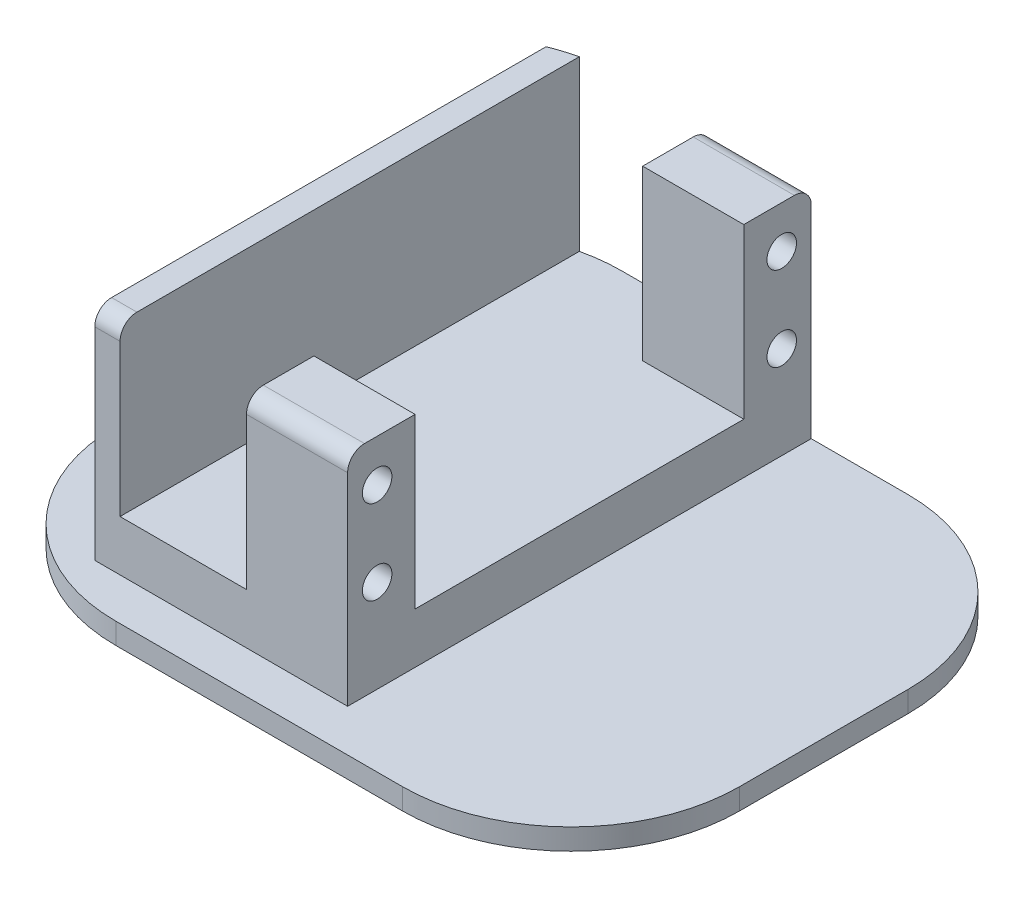
ISO-10303-21;
HEADER;
FILE_DESCRIPTION(('STEP AP214'),'2;1');
FILE_NAME('part.step','',(''),(''),'','','');
FILE_SCHEMA(('AUTOMOTIVE_DESIGN { 1 0 10303 214 1 1 1 1 }'));
ENDSEC;
DATA;
#1=APPLICATION_CONTEXT('core data for automotive mechanical design processes');
#2=APPLICATION_PROTOCOL_DEFINITION('international standard','automotive_design',2000,#1);
#3=PRODUCT_CONTEXT('',#1,'mechanical');
#4=PRODUCT('Part','Part','',(#3));
#5=PRODUCT_RELATED_PRODUCT_CATEGORY('part','',(#4));
#6=PRODUCT_DEFINITION_FORMATION('','',#4);
#7=PRODUCT_DEFINITION_CONTEXT('part definition',#1,'design');
#8=PRODUCT_DEFINITION('design','',#6,#7);
#9=PRODUCT_DEFINITION_SHAPE('','',#8);
#10=(LENGTH_UNIT() NAMED_UNIT(*) SI_UNIT(.MILLI.,.METRE.));
#11=(NAMED_UNIT(*) PLANE_ANGLE_UNIT() SI_UNIT($,.RADIAN.));
#12=(NAMED_UNIT(*) SI_UNIT($,.STERADIAN.) SOLID_ANGLE_UNIT());
#13=UNCERTAINTY_MEASURE_WITH_UNIT(LENGTH_MEASURE(1.E-05),#10,'distance_accuracy_value','');
#14=(GEOMETRIC_REPRESENTATION_CONTEXT(3) GLOBAL_UNCERTAINTY_ASSIGNED_CONTEXT((#13)) GLOBAL_UNIT_ASSIGNED_CONTEXT((#10,
#11,#12)) REPRESENTATION_CONTEXT('',''));
#15=CARTESIAN_POINT('',(0.,0.,0.));
#16=DIRECTION('',(0.,0.,1.));
#17=DIRECTION('',(1.,0.,0.));
#18=AXIS2_PLACEMENT_3D('',#15,#16,#17);
#19=CARTESIAN_POINT('',(12.5,8.5,-60.));
#20=DIRECTION('',(1.,0.,0.));
#21=DIRECTION('',(0.,0.,-1.));
#22=AXIS2_PLACEMENT_3D('',#19,#20,#21);
#23=PLANE('',#22);
#24=CARTESIAN_POINT('',(12.5,18.5,-42.));
#25=DIRECTION('',(1.,0.,0.));
#26=DIRECTION('',(0.,0.,-1.));
#27=AXIS2_PLACEMENT_3D('',#24,#25,#26);
#28=CIRCLE('',#27,3.95);
#29=CARTESIAN_POINT('',(12.5,18.5,-45.95));
#30=VERTEX_POINT('',#29);
#31=EDGE_CURVE('E395',#30,#30,#28,.T.);
#32=ORIENTED_EDGE('',*,*,#31,.T.);
#33=EDGE_LOOP('',(#32));
#34=FACE_BOUND('',#33,.T.);
#35=DIRECTION('',(0.,-1.,0.));
#36=VECTOR('',#35,1.);
#37=CARTESIAN_POINT('',(12.5,8.5,-5.));
#38=LINE('',#37,#36);
#39=CARTESIAN_POINT('',(12.5,26.5,-5.));
#40=VERTEX_POINT('',#39);
#41=CARTESIAN_POINT('',(12.5,2.5,-5.));
#42=VERTEX_POINT('',#41);
#43=EDGE_CURVE('E374',#40,#42,#38,.T.);
#44=ORIENTED_EDGE('',*,*,#43,.F.);
#45=CARTESIAN_POINT('',(12.5,26.5,-7.));
#46=DIRECTION('',(1.,0.,0.));
#47=DIRECTION('',(0.,0.,-1.));
#48=AXIS2_PLACEMENT_3D('',#45,#46,#47);
#49=CIRCLE('',#48,2.);
#50=CARTESIAN_POINT('',(12.5,28.5,-7.));
#51=VERTEX_POINT('',#50);
#52=EDGE_CURVE('E11',#40,#51,#49,.F.);
#53=ORIENTED_EDGE('',*,*,#52,.T.);
#54=DIRECTION('',(0.,0.,1.));
#55=VECTOR('',#54,1.);
#56=CARTESIAN_POINT('',(12.5,28.5,-52.));
#57=LINE('',#56,#55);
#58=CARTESIAN_POINT('',(12.5,28.5,-58.5404962177392));
#59=VERTEX_POINT('',#58);
#60=EDGE_CURVE('E218',#59,#51,#57,.T.);
#61=ORIENTED_EDGE('',*,*,#60,.F.);
#62=DIRECTION('',(0.,-1.,0.));
#63=VECTOR('',#62,1.);
#64=CARTESIAN_POINT('',(12.5,28.5,-58.5404962177392));
#65=LINE('',#64,#63);
#66=CARTESIAN_POINT('',(12.5,2.5,-58.5404962177392));
#67=VERTEX_POINT('',#66);
#68=EDGE_CURVE('E329',#59,#67,#65,.T.);
#69=ORIENTED_EDGE('',*,*,#68,.T.);
#70=DIRECTION('',(0.,0.,1.));
#71=VECTOR('',#70,1.);
#72=CARTESIAN_POINT('',(12.5,2.5,-60.));
#73=LINE('',#72,#71);
#74=EDGE_CURVE('E287',#67,#42,#73,.T.);
#75=ORIENTED_EDGE('',*,*,#74,.T.);
#76=EDGE_LOOP('',(#44,#53,#61,#69,#75));
#77=FACE_BOUND('',#76,.T.);
#78=ADVANCED_FACE('F33',(#34,#77),#23,.F.);
#79=CARTESIAN_POINT('',(0.,8.5,0.));
#80=DIRECTION('',(0.,1.,0.));
#81=DIRECTION('',(0.,0.,1.));
#82=AXIS2_PLACEMENT_3D('',#79,#80,#81);
#83=PLANE('',#82);
#84=DIRECTION('',(-1.,0.,0.));
#85=VECTOR('',#84,1.);
#86=CARTESIAN_POINT('',(12.5,8.5,-60.));
#87=LINE('',#86,#85);
#88=CARTESIAN_POINT('',(30.5,8.5,-60.));
#89=VERTEX_POINT('',#88);
#90=CARTESIAN_POINT('',(20.,8.5,-60.));
#91=VERTEX_POINT('',#90);
#92=EDGE_CURVE('E254',#89,#91,#87,.T.);
#93=ORIENTED_EDGE('',*,*,#92,.T.);
#94=CARTESIAN_POINT('',(20.,8.5,-40.));
#95=DIRECTION('',(0.,1.,0.));
#96=DIRECTION('',(0.,0.,1.));
#97=AXIS2_PLACEMENT_3D('',#94,#95,#96);
#98=CIRCLE('',#97,20.);
#99=CARTESIAN_POINT('',(15.5,8.5,-59.4871752699051));
#100=VERTEX_POINT('',#99);
#101=EDGE_CURVE('E343',#91,#100,#98,.T.);
#102=ORIENTED_EDGE('',*,*,#101,.T.);
#103=DIRECTION('',(0.,0.,-1.));
#104=VECTOR('',#103,1.);
#105=CARTESIAN_POINT('',(15.5,8.5,-52.));
#106=LINE('',#105,#104);
#107=CARTESIAN_POINT('',(15.5,8.5,-5.));
#108=VERTEX_POINT('',#107);
#109=EDGE_CURVE('E215',#108,#100,#106,.T.);
#110=ORIENTED_EDGE('',*,*,#109,.F.);
#111=DIRECTION('',(1.,0.,0.));
#112=VECTOR('',#111,1.);
#113=CARTESIAN_POINT('',(12.5,8.5,-5.));
#114=LINE('',#113,#112);
#115=CARTESIAN_POINT('',(30.5,8.5,-5.));
#116=VERTEX_POINT('',#115);
#117=EDGE_CURVE('E255',#108,#116,#114,.T.);
#118=ORIENTED_EDGE('',*,*,#117,.T.);
#119=DIRECTION('',(0.,0.,1.));
#120=VECTOR('',#119,1.);
#121=CARTESIAN_POINT('',(30.5,8.5,-13.));
#122=LINE('',#121,#120);
#123=CARTESIAN_POINT('',(30.5,8.5,-13.));
#124=VERTEX_POINT('',#123);
#125=EDGE_CURVE('E198',#124,#116,#122,.T.);
#126=ORIENTED_EDGE('',*,*,#125,.F.);
#127=DIRECTION('',(-1.,0.,0.));
#128=VECTOR('',#127,1.);
#129=CARTESIAN_POINT('',(30.5,8.5,-13.));
#130=LINE('',#129,#128);
#131=CARTESIAN_POINT('',(42.5,8.5,-13.));
#132=VERTEX_POINT('',#131);
#133=EDGE_CURVE('E524',#132,#124,#130,.T.);
#134=ORIENTED_EDGE('',*,*,#133,.F.);
#135=DIRECTION('',(0.,0.,-1.));
#136=VECTOR('',#135,1.);
#137=CARTESIAN_POINT('',(42.5,8.5,-60.));
#138=LINE('',#137,#136);
#139=CARTESIAN_POINT('',(42.5,8.5,-52.));
#140=VERTEX_POINT('',#139);
#141=EDGE_CURVE('E213',#132,#140,#138,.T.);
#142=ORIENTED_EDGE('',*,*,#141,.T.);
#143=DIRECTION('',(1.,0.,0.));
#144=VECTOR('',#143,1.);
#145=CARTESIAN_POINT('',(42.5,8.5,-52.));
#146=LINE('',#145,#144);
#147=CARTESIAN_POINT('',(30.5,8.5,-52.));
#148=VERTEX_POINT('',#147);
#149=EDGE_CURVE('E234',#148,#140,#146,.T.);
#150=ORIENTED_EDGE('',*,*,#149,.F.);
#151=DIRECTION('',(0.,0.,1.));
#152=VECTOR('',#151,1.);
#153=CARTESIAN_POINT('',(30.5,8.5,-52.));
#154=LINE('',#153,#152);
#155=EDGE_CURVE('E229',#89,#148,#154,.T.);
#156=ORIENTED_EDGE('',*,*,#155,.F.);
#157=EDGE_LOOP('',(#93,#102,#110,#118,#126,#134,#142,#150,#156));
#158=FACE_BOUND('',#157,.T.);
#159=ADVANCED_FACE('F463',(#158),#83,.T.);
#160=CARTESIAN_POINT('',(0.,2.5,0.));
#161=DIRECTION('',(0.,-1.,0.));
#162=DIRECTION('',(0.,0.,-1.));
#163=AXIS2_PLACEMENT_3D('',#160,#161,#162);
#164=PLANE('',#163);
#165=DIRECTION('',(0.,0.,-1.));
#166=VECTOR('',#165,1.);
#167=CARTESIAN_POINT('',(74.,2.5,0.));
#168=LINE('',#167,#166);
#169=CARTESIAN_POINT('',(74.,2.5,-20.));
#170=VERTEX_POINT('',#169);
#171=CARTESIAN_POINT('',(74.,2.5,-40.));
#172=VERTEX_POINT('',#171);
#173=EDGE_CURVE('E383',#170,#172,#168,.T.);
#174=ORIENTED_EDGE('',*,*,#173,.T.);
#175=CARTESIAN_POINT('',(54.,2.5,-40.));
#176=DIRECTION('',(0.,-1.,0.));
#177=DIRECTION('',(0.,0.,-1.));
#178=AXIS2_PLACEMENT_3D('',#175,#176,#177);
#179=CIRCLE('',#178,20.);
#180=CARTESIAN_POINT('',(54.,2.5,-60.));
#181=VERTEX_POINT('',#180);
#182=EDGE_CURVE('E355',#172,#181,#179,.F.);
#183=ORIENTED_EDGE('',*,*,#182,.T.);
#184=DIRECTION('',(-1.,0.,0.));
#185=VECTOR('',#184,1.);
#186=CARTESIAN_POINT('',(0.,2.5,-60.));
#187=LINE('',#186,#185);
#188=CARTESIAN_POINT('',(42.5,2.5,-60.));
#189=VERTEX_POINT('',#188);
#190=EDGE_CURVE('E386',#181,#189,#187,.T.);
#191=ORIENTED_EDGE('',*,*,#190,.T.);
#192=DIRECTION('',(0.,0.,-1.));
#193=VECTOR('',#192,1.);
#194=CARTESIAN_POINT('',(42.5,2.5,-60.));
#195=LINE('',#194,#193);
#196=CARTESIAN_POINT('',(42.5,2.5,-5.));
#197=VERTEX_POINT('',#196);
#198=EDGE_CURVE('E369',#197,#189,#195,.T.);
#199=ORIENTED_EDGE('',*,*,#198,.F.);
#200=DIRECTION('',(1.,0.,0.));
#201=VECTOR('',#200,1.);
#202=CARTESIAN_POINT('',(12.5,2.5,-5.));
#203=LINE('',#202,#201);
#204=EDGE_CURVE('E262',#42,#197,#203,.T.);
#205=ORIENTED_EDGE('',*,*,#204,.F.);
#206=ORIENTED_EDGE('',*,*,#74,.F.);
#207=CARTESIAN_POINT('',(20.,2.5,-40.));
#208=DIRECTION('',(0.,-1.,0.));
#209=DIRECTION('',(0.,0.,-1.));
#210=AXIS2_PLACEMENT_3D('',#207,#208,#209);
#211=CIRCLE('',#210,20.);
#212=CARTESIAN_POINT('',(0.,2.5,-40.));
#213=VERTEX_POINT('',#212);
#214=EDGE_CURVE('E337',#67,#213,#211,.F.);
#215=ORIENTED_EDGE('',*,*,#214,.T.);
#216=DIRECTION('',(0.,0.,1.));
#217=VECTOR('',#216,1.);
#218=CARTESIAN_POINT('',(0.,2.5,0.));
#219=LINE('',#218,#217);
#220=CARTESIAN_POINT('',(0.,2.5,-20.));
#221=VERTEX_POINT('',#220);
#222=EDGE_CURVE('E377',#213,#221,#219,.T.);
#223=ORIENTED_EDGE('',*,*,#222,.T.);
#224=CARTESIAN_POINT('',(20.,2.5,-20.));
#225=DIRECTION('',(0.,-1.,0.));
#226=DIRECTION('',(0.,0.,-1.));
#227=AXIS2_PLACEMENT_3D('',#224,#225,#226);
#228=CIRCLE('',#227,20.);
#229=CARTESIAN_POINT('',(20.,2.5,0.));
#230=VERTEX_POINT('',#229);
#231=EDGE_CURVE('E359',#221,#230,#228,.F.);
#232=ORIENTED_EDGE('',*,*,#231,.T.);
#233=DIRECTION('',(1.,0.,0.));
#234=VECTOR('',#233,1.);
#235=CARTESIAN_POINT('',(0.,2.5,0.));
#236=LINE('',#235,#234);
#237=CARTESIAN_POINT('',(54.,2.5,0.));
#238=VERTEX_POINT('',#237);
#239=EDGE_CURVE('E380',#230,#238,#236,.T.);
#240=ORIENTED_EDGE('',*,*,#239,.T.);
#241=CARTESIAN_POINT('',(54.,2.5,-20.));
#242=DIRECTION('',(0.,-1.,0.));
#243=DIRECTION('',(0.,0.,-1.));
#244=AXIS2_PLACEMENT_3D('',#241,#242,#243);
#245=CIRCLE('',#244,20.);
#246=EDGE_CURVE('E357',#238,#170,#245,.F.);
#247=ORIENTED_EDGE('',*,*,#246,.T.);
#248=EDGE_LOOP('',(#174,#183,#191,#199,#205,#206,#215,#223,#232,#240,#247));
#249=FACE_BOUND('',#248,.T.);
#250=ADVANCED_FACE('F422',(#249),#164,.F.);
#251=CARTESIAN_POINT('',(0.,2.5,0.));
#252=DIRECTION('',(1.,0.,0.));
#253=DIRECTION('',(0.,0.,-1.));
#254=AXIS2_PLACEMENT_3D('',#251,#252,#253);
#255=PLANE('',#254);
#256=DIRECTION('',(0.,0.,1.));
#257=VECTOR('',#256,1.);
#258=CARTESIAN_POINT('',(0.,0.,0.));
#259=LINE('',#258,#257);
#260=CARTESIAN_POINT('',(0.,0.,-40.));
#261=VERTEX_POINT('',#260);
#262=CARTESIAN_POINT('',(0.,0.,-20.));
#263=VERTEX_POINT('',#262);
#264=EDGE_CURVE('E376',#261,#263,#259,.T.);
#265=ORIENTED_EDGE('',*,*,#264,.T.);
#266=DIRECTION('',(0.,-1.,0.));
#267=VECTOR('',#266,1.);
#268=CARTESIAN_POINT('',(0.,2.5,-20.));
#269=LINE('',#268,#267);
#270=EDGE_CURVE('E345',#263,#221,#269,.F.);
#271=ORIENTED_EDGE('',*,*,#270,.T.);
#272=ORIENTED_EDGE('',*,*,#222,.F.);
#273=DIRECTION('',(0.,-1.,0.));
#274=VECTOR('',#273,1.);
#275=CARTESIAN_POINT('',(0.,2.5,-40.));
#276=LINE('',#275,#274);
#277=EDGE_CURVE('E347',#213,#261,#276,.T.);
#278=ORIENTED_EDGE('',*,*,#277,.T.);
#279=EDGE_LOOP('',(#265,#271,#272,#278));
#280=FACE_BOUND('',#279,.T.);
#281=ADVANCED_FACE('F443',(#280),#255,.F.);
#282=CARTESIAN_POINT('',(0.,2.5,0.));
#283=DIRECTION('',(0.,0.,-1.));
#284=DIRECTION('',(-1.,0.,0.));
#285=AXIS2_PLACEMENT_3D('',#282,#283,#284);
#286=PLANE('',#285);
#287=DIRECTION('',(1.,0.,0.));
#288=VECTOR('',#287,1.);
#289=CARTESIAN_POINT('',(0.,0.,0.));
#290=LINE('',#289,#288);
#291=CARTESIAN_POINT('',(20.,0.,0.));
#292=VERTEX_POINT('',#291);
#293=CARTESIAN_POINT('',(54.,0.,0.));
#294=VERTEX_POINT('',#293);
#295=EDGE_CURVE('E435',#292,#294,#290,.T.);
#296=ORIENTED_EDGE('',*,*,#295,.T.);
#297=DIRECTION('',(0.,-1.,0.));
#298=VECTOR('',#297,1.);
#299=CARTESIAN_POINT('',(54.,2.5,0.));
#300=LINE('',#299,#298);
#301=EDGE_CURVE('E350',#294,#238,#300,.F.);
#302=ORIENTED_EDGE('',*,*,#301,.T.);
#303=ORIENTED_EDGE('',*,*,#239,.F.);
#304=DIRECTION('',(0.,-1.,0.));
#305=VECTOR('',#304,1.);
#306=CARTESIAN_POINT('',(20.,2.5,0.));
#307=LINE('',#306,#305);
#308=EDGE_CURVE('E352',#230,#292,#307,.T.);
#309=ORIENTED_EDGE('',*,*,#308,.T.);
#310=EDGE_LOOP('',(#296,#302,#303,#309));
#311=FACE_BOUND('',#310,.T.);
#312=ADVANCED_FACE('F450',(#311),#286,.F.);
#313=CARTESIAN_POINT('',(74.,2.5,0.));
#314=DIRECTION('',(-1.,0.,0.));
#315=DIRECTION('',(0.,0.,1.));
#316=AXIS2_PLACEMENT_3D('',#313,#314,#315);
#317=PLANE('',#316);
#318=DIRECTION('',(0.,0.,-1.));
#319=VECTOR('',#318,1.);
#320=CARTESIAN_POINT('',(74.,0.,0.));
#321=LINE('',#320,#319);
#322=CARTESIAN_POINT('',(74.,0.,-20.));
#323=VERTEX_POINT('',#322);
#324=CARTESIAN_POINT('',(74.,0.,-40.));
#325=VERTEX_POINT('',#324);
#326=EDGE_CURVE('E418',#323,#325,#321,.T.);
#327=ORIENTED_EDGE('',*,*,#326,.T.);
#328=DIRECTION('',(0.,-1.,0.));
#329=VECTOR('',#328,1.);
#330=CARTESIAN_POINT('',(74.,2.5,-40.));
#331=LINE('',#330,#329);
#332=EDGE_CURVE('E361',#325,#172,#331,.F.);
#333=ORIENTED_EDGE('',*,*,#332,.T.);
#334=ORIENTED_EDGE('',*,*,#173,.F.);
#335=DIRECTION('',(0.,-1.,0.));
#336=VECTOR('',#335,1.);
#337=CARTESIAN_POINT('',(74.,2.5,-20.));
#338=LINE('',#337,#336);
#339=EDGE_CURVE('E409',#170,#323,#338,.T.);
#340=ORIENTED_EDGE('',*,*,#339,.T.);
#341=EDGE_LOOP('',(#327,#333,#334,#340));
#342=FACE_BOUND('',#341,.T.);
#343=ADVANCED_FACE('F417',(#342),#317,.F.);
#344=CARTESIAN_POINT('',(0.,2.5,-60.));
#345=DIRECTION('',(0.,0.,1.));
#346=DIRECTION('',(1.,0.,0.));
#347=AXIS2_PLACEMENT_3D('',#344,#345,#346);
#348=PLANE('',#347);
#349=DIRECTION('',(0.,-1.,0.));
#350=VECTOR('',#349,1.);
#351=CARTESIAN_POINT('',(30.5,28.5,-60.));
#352=LINE('',#351,#350);
#353=CARTESIAN_POINT('',(30.5,26.5,-60.));
#354=VERTEX_POINT('',#353);
#355=EDGE_CURVE('E281',#354,#89,#352,.T.);
#356=ORIENTED_EDGE('',*,*,#355,.F.);
#357=DIRECTION('',(-1.,0.,0.));
#358=VECTOR('',#357,1.);
#359=CARTESIAN_POINT('',(0.,26.5,-60.));
#360=LINE('',#359,#358);
#361=CARTESIAN_POINT('',(42.5,26.5,-60.));
#362=VERTEX_POINT('',#361);
#363=EDGE_CURVE('E297',#354,#362,#360,.F.);
#364=ORIENTED_EDGE('',*,*,#363,.T.);
#365=DIRECTION('',(0.,-1.,0.));
#366=VECTOR('',#365,1.);
#367=CARTESIAN_POINT('',(42.5,8.5,-60.));
#368=LINE('',#367,#366);
#369=EDGE_CURVE('E268',#362,#189,#368,.T.);
#370=ORIENTED_EDGE('',*,*,#369,.T.);
#371=ORIENTED_EDGE('',*,*,#190,.F.);
#372=DIRECTION('',(0.,-1.,0.));
#373=VECTOR('',#372,1.);
#374=CARTESIAN_POINT('',(54.,2.5,-60.));
#375=LINE('',#374,#373);
#376=CARTESIAN_POINT('',(54.,0.,-60.));
#377=VERTEX_POINT('',#376);
#378=EDGE_CURVE('E399',#181,#377,#375,.T.);
#379=ORIENTED_EDGE('',*,*,#378,.T.);
#380=DIRECTION('',(-1.,0.,0.));
#381=VECTOR('',#380,1.);
#382=CARTESIAN_POINT('',(0.,0.,-60.));
#383=LINE('',#382,#381);
#384=CARTESIAN_POINT('',(20.,0.,-60.));
#385=VERTEX_POINT('',#384);
#386=EDGE_CURVE('E367',#377,#385,#383,.T.);
#387=ORIENTED_EDGE('',*,*,#386,.T.);
#388=DIRECTION('',(0.,-1.,0.));
#389=VECTOR('',#388,1.);
#390=CARTESIAN_POINT('',(20.,2.5,-60.));
#391=LINE('',#390,#389);
#392=EDGE_CURVE('E397',#385,#91,#391,.F.);
#393=ORIENTED_EDGE('',*,*,#392,.T.);
#394=ORIENTED_EDGE('',*,*,#92,.F.);
#395=EDGE_LOOP('',(#356,#364,#370,#371,#379,#387,#393,#394));
#396=FACE_BOUND('',#395,.T.);
#397=ADVANCED_FACE('F430',(#396),#348,.F.);
#398=CARTESIAN_POINT('',(0.,0.,0.));
#399=DIRECTION('',(0.,-1.,0.));
#400=DIRECTION('',(0.,0.,-1.));
#401=AXIS2_PLACEMENT_3D('',#398,#399,#400);
#402=PLANE('',#401);
#403=ORIENTED_EDGE('',*,*,#386,.F.);
#404=CARTESIAN_POINT('',(54.,0.,-40.));
#405=DIRECTION('',(0.,-1.,0.));
#406=DIRECTION('',(0.,0.,-1.));
#407=AXIS2_PLACEMENT_3D('',#404,#405,#406);
#408=CIRCLE('',#407,20.);
#409=EDGE_CURVE('E408',#377,#325,#408,.T.);
#410=ORIENTED_EDGE('',*,*,#409,.T.);
#411=ORIENTED_EDGE('',*,*,#326,.F.);
#412=CARTESIAN_POINT('',(54.,0.,-20.));
#413=DIRECTION('',(0.,-1.,0.));
#414=DIRECTION('',(0.,0.,-1.));
#415=AXIS2_PLACEMENT_3D('',#412,#413,#414);
#416=CIRCLE('',#415,20.);
#417=EDGE_CURVE('E406',#323,#294,#416,.T.);
#418=ORIENTED_EDGE('',*,*,#417,.T.);
#419=ORIENTED_EDGE('',*,*,#295,.F.);
#420=CARTESIAN_POINT('',(20.,0.,-20.));
#421=DIRECTION('',(0.,-1.,0.));
#422=DIRECTION('',(0.,0.,-1.));
#423=AXIS2_PLACEMENT_3D('',#420,#421,#422);
#424=CIRCLE('',#423,20.);
#425=EDGE_CURVE('E404',#292,#263,#424,.T.);
#426=ORIENTED_EDGE('',*,*,#425,.T.);
#427=ORIENTED_EDGE('',*,*,#264,.F.);
#428=CARTESIAN_POINT('',(20.,0.,-40.));
#429=DIRECTION('',(0.,-1.,0.));
#430=DIRECTION('',(0.,0.,-1.));
#431=AXIS2_PLACEMENT_3D('',#428,#429,#430);
#432=CIRCLE('',#431,20.);
#433=EDGE_CURVE('E402',#261,#385,#432,.T.);
#434=ORIENTED_EDGE('',*,*,#433,.T.);
#435=EDGE_LOOP('',(#403,#410,#411,#418,#419,#426,#427,#434));
#436=FACE_BOUND('',#435,.T.);
#437=ADVANCED_FACE('F433',(#436),#402,.T.);
#438=CARTESIAN_POINT('',(12.5,8.5,-5.));
#439=DIRECTION('',(0.,0.,-1.));
#440=DIRECTION('',(-1.,0.,0.));
#441=AXIS2_PLACEMENT_3D('',#438,#439,#440);
#442=PLANE('',#441);
#443=DIRECTION('',(0.,-1.,0.));
#444=VECTOR('',#443,1.);
#445=CARTESIAN_POINT('',(42.5,8.5,-5.));
#446=LINE('',#445,#444);
#447=CARTESIAN_POINT('',(42.5,26.5,-5.));
#448=VERTEX_POINT('',#447);
#449=EDGE_CURVE('E299',#448,#197,#446,.T.);
#450=ORIENTED_EDGE('',*,*,#449,.F.);
#451=DIRECTION('',(1.,0.,0.));
#452=VECTOR('',#451,1.);
#453=CARTESIAN_POINT('',(12.5,26.5,-5.));
#454=LINE('',#453,#452);
#455=CARTESIAN_POINT('',(30.5,26.5,-5.));
#456=VERTEX_POINT('',#455);
#457=EDGE_CURVE('E308',#448,#456,#454,.F.);
#458=ORIENTED_EDGE('',*,*,#457,.T.);
#459=DIRECTION('',(0.,-1.,0.));
#460=VECTOR('',#459,1.);
#461=CARTESIAN_POINT('',(30.5,28.5,-5.));
#462=LINE('',#461,#460);
#463=EDGE_CURVE('E220',#456,#116,#462,.T.);
#464=ORIENTED_EDGE('',*,*,#463,.T.);
#465=ORIENTED_EDGE('',*,*,#117,.F.);
#466=DIRECTION('',(0.,-1.,0.));
#467=VECTOR('',#466,1.);
#468=CARTESIAN_POINT('',(15.5,28.5,-5.));
#469=LINE('',#468,#467);
#470=CARTESIAN_POINT('',(15.5,26.5,-5.));
#471=VERTEX_POINT('',#470);
#472=EDGE_CURVE('E226',#471,#108,#469,.T.);
#473=ORIENTED_EDGE('',*,*,#472,.F.);
#474=DIRECTION('',(1.,0.,0.));
#475=VECTOR('',#474,1.);
#476=CARTESIAN_POINT('',(12.5,26.5,-5.));
#477=LINE('',#476,#475);
#478=EDGE_CURVE('E306',#471,#40,#477,.F.);
#479=ORIENTED_EDGE('',*,*,#478,.T.);
#480=ORIENTED_EDGE('',*,*,#43,.T.);
#481=ORIENTED_EDGE('',*,*,#204,.T.);
#482=EDGE_LOOP('',(#450,#458,#464,#465,#473,#479,#480,#481));
#483=FACE_BOUND('',#482,.T.);
#484=ADVANCED_FACE('F322',(#483),#442,.F.);
#485=CARTESIAN_POINT('',(42.5,8.5,-60.));
#486=DIRECTION('',(-1.,0.,0.));
#487=DIRECTION('',(0.,0.,1.));
#488=AXIS2_PLACEMENT_3D('',#485,#486,#487);
#489=PLANE('',#488);
#490=CARTESIAN_POINT('',(42.5,13.5,-56.5));
#491=DIRECTION('',(1.,0.,0.));
#492=DIRECTION('',(0.,0.,-1.));
#493=AXIS2_PLACEMENT_3D('',#490,#491,#492);
#494=CIRCLE('',#493,1.75);
#495=CARTESIAN_POINT('',(42.5,13.5,-58.25));
#496=VERTEX_POINT('',#495);
#497=EDGE_CURVE('E505',#496,#496,#494,.T.);
#498=ORIENTED_EDGE('',*,*,#497,.F.);
#499=EDGE_LOOP('',(#498));
#500=FACE_BOUND('',#499,.T.);
#501=CARTESIAN_POINT('',(42.5,23.5,-56.5));
#502=DIRECTION('',(1.,0.,0.));
#503=DIRECTION('',(0.,0.,-1.));
#504=AXIS2_PLACEMENT_3D('',#501,#502,#503);
#505=CIRCLE('',#504,1.75);
#506=CARTESIAN_POINT('',(42.5,23.5,-58.25));
#507=VERTEX_POINT('',#506);
#508=EDGE_CURVE('E504',#507,#507,#505,.T.);
#509=ORIENTED_EDGE('',*,*,#508,.F.);
#510=EDGE_LOOP('',(#509));
#511=FACE_BOUND('',#510,.T.);
#512=CARTESIAN_POINT('',(42.5,13.5,-8.5));
#513=DIRECTION('',(1.,0.,0.));
#514=DIRECTION('',(0.,0.,-1.));
#515=AXIS2_PLACEMENT_3D('',#512,#513,#514);
#516=CIRCLE('',#515,1.75);
#517=CARTESIAN_POINT('',(42.5,13.5,-10.25));
#518=VERTEX_POINT('',#517);
#519=EDGE_CURVE('E508',#518,#518,#516,.T.);
#520=ORIENTED_EDGE('',*,*,#519,.F.);
#521=EDGE_LOOP('',(#520));
#522=FACE_BOUND('',#521,.T.);
#523=CARTESIAN_POINT('',(42.5,23.5,-8.5));
#524=DIRECTION('',(1.,0.,0.));
#525=DIRECTION('',(0.,0.,-1.));
#526=AXIS2_PLACEMENT_3D('',#523,#524,#525);
#527=CIRCLE('',#526,1.75);
#528=CARTESIAN_POINT('',(42.5,23.5,-10.25));
#529=VERTEX_POINT('',#528);
#530=EDGE_CURVE('E511',#529,#529,#527,.T.);
#531=ORIENTED_EDGE('',*,*,#530,.F.);
#532=EDGE_LOOP('',(#531));
#533=FACE_BOUND('',#532,.T.);
#534=ORIENTED_EDGE('',*,*,#369,.F.);
#535=CARTESIAN_POINT('',(42.5,26.5,-58.));
#536=DIRECTION('',(-1.,0.,0.));
#537=DIRECTION('',(0.,0.,1.));
#538=AXIS2_PLACEMENT_3D('',#535,#536,#537);
#539=CIRCLE('',#538,2.);
#540=CARTESIAN_POINT('',(42.5,28.5,-58.));
#541=VERTEX_POINT('',#540);
#542=EDGE_CURVE('E303',#362,#541,#539,.F.);
#543=ORIENTED_EDGE('',*,*,#542,.T.);
#544=DIRECTION('',(0.,0.,-1.));
#545=VECTOR('',#544,1.);
#546=CARTESIAN_POINT('',(42.5,28.5,-60.));
#547=LINE('',#546,#545);
#548=CARTESIAN_POINT('',(42.5,28.5,-52.));
#549=VERTEX_POINT('',#548);
#550=EDGE_CURVE('E230',#549,#541,#547,.T.);
#551=ORIENTED_EDGE('',*,*,#550,.F.);
#552=DIRECTION('',(0.,-1.,0.));
#553=VECTOR('',#552,1.);
#554=CARTESIAN_POINT('',(42.5,28.5,-52.));
#555=LINE('',#554,#553);
#556=EDGE_CURVE('E238',#549,#140,#555,.T.);
#557=ORIENTED_EDGE('',*,*,#556,.T.);
#558=ORIENTED_EDGE('',*,*,#141,.F.);
#559=DIRECTION('',(0.,-1.,0.));
#560=VECTOR('',#559,1.);
#561=CARTESIAN_POINT('',(42.5,28.5,-13.));
#562=LINE('',#561,#560);
#563=CARTESIAN_POINT('',(42.5,28.5,-13.));
#564=VERTEX_POINT('',#563);
#565=EDGE_CURVE('E204',#564,#132,#562,.T.);
#566=ORIENTED_EDGE('',*,*,#565,.F.);
#567=DIRECTION('',(0.,0.,-1.));
#568=VECTOR('',#567,1.);
#569=CARTESIAN_POINT('',(42.5,28.5,-5.));
#570=LINE('',#569,#568);
#571=CARTESIAN_POINT('',(42.5,28.5,-7.));
#572=VERTEX_POINT('',#571);
#573=EDGE_CURVE('E188',#572,#564,#570,.T.);
#574=ORIENTED_EDGE('',*,*,#573,.F.);
#575=CARTESIAN_POINT('',(42.5,26.5,-7.));
#576=DIRECTION('',(-1.,0.,0.));
#577=DIRECTION('',(0.,0.,1.));
#578=AXIS2_PLACEMENT_3D('',#575,#576,#577);
#579=CIRCLE('',#578,2.);
#580=EDGE_CURVE('E301',#572,#448,#579,.F.);
#581=ORIENTED_EDGE('',*,*,#580,.T.);
#582=ORIENTED_EDGE('',*,*,#449,.T.);
#583=ORIENTED_EDGE('',*,*,#198,.T.);
#584=EDGE_LOOP('',(#534,#543,#551,#557,#558,#566,#574,#581,#582,#583));
#585=FACE_BOUND('',#584,.T.);
#586=ADVANCED_FACE('F211',(#500,#511,#522,#533,#585),#489,.F.);
#587=CARTESIAN_POINT('',(30.5,28.5,-52.));
#588=DIRECTION('',(1.,0.,0.));
#589=DIRECTION('',(0.,0.,-1.));
#590=AXIS2_PLACEMENT_3D('',#587,#588,#589);
#591=PLANE('',#590);
#592=CARTESIAN_POINT('',(30.5,13.5,-56.5));
#593=DIRECTION('',(1.,0.,0.));
#594=DIRECTION('',(0.,0.,-1.));
#595=AXIS2_PLACEMENT_3D('',#592,#593,#594);
#596=CIRCLE('',#595,1.75);
#597=CARTESIAN_POINT('',(30.5,13.5,-58.25));
#598=VERTEX_POINT('',#597);
#599=EDGE_CURVE('E501',#598,#598,#596,.T.);
#600=ORIENTED_EDGE('',*,*,#599,.T.);
#601=EDGE_LOOP('',(#600));
#602=FACE_BOUND('',#601,.T.);
#603=CARTESIAN_POINT('',(30.5,23.5,-56.5));
#604=DIRECTION('',(1.,0.,0.));
#605=DIRECTION('',(0.,0.,-1.));
#606=AXIS2_PLACEMENT_3D('',#603,#604,#605);
#607=CIRCLE('',#606,1.75);
#608=CARTESIAN_POINT('',(30.5,23.5,-58.25));
#609=VERTEX_POINT('',#608);
#610=EDGE_CURVE('E506',#609,#609,#607,.T.);
#611=ORIENTED_EDGE('',*,*,#610,.T.);
#612=EDGE_LOOP('',(#611));
#613=FACE_BOUND('',#612,.T.);
#614=DIRECTION('',(0.,0.,1.));
#615=VECTOR('',#614,1.);
#616=CARTESIAN_POINT('',(30.5,28.5,-52.));
#617=LINE('',#616,#615);
#618=CARTESIAN_POINT('',(30.5,28.5,-58.));
#619=VERTEX_POINT('',#618);
#620=CARTESIAN_POINT('',(30.5,28.5,-52.));
#621=VERTEX_POINT('',#620);
#622=EDGE_CURVE('E233',#619,#621,#617,.T.);
#623=ORIENTED_EDGE('',*,*,#622,.F.);
#624=CARTESIAN_POINT('',(30.5,26.5,-58.));
#625=DIRECTION('',(1.,0.,0.));
#626=DIRECTION('',(0.,0.,-1.));
#627=AXIS2_PLACEMENT_3D('',#624,#625,#626);
#628=CIRCLE('',#627,2.);
#629=EDGE_CURVE('E295',#619,#354,#628,.F.);
#630=ORIENTED_EDGE('',*,*,#629,.T.);
#631=ORIENTED_EDGE('',*,*,#355,.T.);
#632=ORIENTED_EDGE('',*,*,#155,.T.);
#633=DIRECTION('',(0.,-1.,0.));
#634=VECTOR('',#633,1.);
#635=CARTESIAN_POINT('',(30.5,28.5,-52.));
#636=LINE('',#635,#634);
#637=EDGE_CURVE('E241',#621,#148,#636,.T.);
#638=ORIENTED_EDGE('',*,*,#637,.F.);
#639=EDGE_LOOP('',(#623,#630,#631,#632,#638));
#640=FACE_BOUND('',#639,.T.);
#641=ADVANCED_FACE('F278',(#602,#613,#640),#591,.F.);
#642=CARTESIAN_POINT('',(42.5,28.5,-52.));
#643=DIRECTION('',(0.,0.,-1.));
#644=DIRECTION('',(-1.,0.,0.));
#645=AXIS2_PLACEMENT_3D('',#642,#643,#644);
#646=PLANE('',#645);
#647=ORIENTED_EDGE('',*,*,#149,.T.);
#648=ORIENTED_EDGE('',*,*,#556,.F.);
#649=DIRECTION('',(1.,0.,0.));
#650=VECTOR('',#649,1.);
#651=CARTESIAN_POINT('',(42.5,28.5,-52.));
#652=LINE('',#651,#650);
#653=EDGE_CURVE('E236',#621,#549,#652,.T.);
#654=ORIENTED_EDGE('',*,*,#653,.F.);
#655=ORIENTED_EDGE('',*,*,#637,.T.);
#656=EDGE_LOOP('',(#647,#648,#654,#655));
#657=FACE_BOUND('',#656,.T.);
#658=ADVANCED_FACE('F285',(#657),#646,.F.);
#659=CARTESIAN_POINT('',(0.,28.5,0.));
#660=DIRECTION('',(0.,-1.,0.));
#661=DIRECTION('',(0.,0.,-1.));
#662=AXIS2_PLACEMENT_3D('',#659,#660,#661);
#663=PLANE('',#662);
#664=ORIENTED_EDGE('',*,*,#550,.T.);
#665=DIRECTION('',(-1.,0.,0.));
#666=VECTOR('',#665,1.);
#667=CARTESIAN_POINT('',(0.,28.5,-58.));
#668=LINE('',#667,#666);
#669=EDGE_CURVE('E293',#541,#619,#668,.T.);
#670=ORIENTED_EDGE('',*,*,#669,.T.);
#671=ORIENTED_EDGE('',*,*,#622,.T.);
#672=ORIENTED_EDGE('',*,*,#653,.T.);
#673=EDGE_LOOP('',(#664,#670,#671,#672));
#674=FACE_BOUND('',#673,.T.);
#675=ADVANCED_FACE('F544',(#674),#663,.F.);
#676=CARTESIAN_POINT('',(15.5,28.5,-52.));
#677=DIRECTION('',(-1.,0.,0.));
#678=DIRECTION('',(0.,0.,1.));
#679=AXIS2_PLACEMENT_3D('',#676,#677,#678);
#680=PLANE('',#679);
#681=DIRECTION('',(0.,0.,-1.));
#682=VECTOR('',#681,1.);
#683=CARTESIAN_POINT('',(15.5,28.5,-13.));
#684=LINE('',#683,#682);
#685=CARTESIAN_POINT('',(15.5,28.5,-7.));
#686=VERTEX_POINT('',#685);
#687=CARTESIAN_POINT('',(15.5,28.5,-59.4871752699051));
#688=VERTEX_POINT('',#687);
#689=EDGE_CURVE('E225',#686,#688,#684,.T.);
#690=ORIENTED_EDGE('',*,*,#689,.F.);
#691=CARTESIAN_POINT('',(15.5,26.5,-7.));
#692=DIRECTION('',(-1.,0.,0.));
#693=DIRECTION('',(0.,0.,1.));
#694=AXIS2_PLACEMENT_3D('',#691,#692,#693);
#695=CIRCLE('',#694,2.);
#696=EDGE_CURVE('E41',#686,#471,#695,.F.);
#697=ORIENTED_EDGE('',*,*,#696,.T.);
#698=ORIENTED_EDGE('',*,*,#472,.T.);
#699=ORIENTED_EDGE('',*,*,#109,.T.);
#700=DIRECTION('',(0.,-1.,0.));
#701=VECTOR('',#700,1.);
#702=CARTESIAN_POINT('',(15.5,8.5,-59.4871752699051));
#703=LINE('',#702,#701);
#704=EDGE_CURVE('E339',#100,#688,#703,.F.);
#705=ORIENTED_EDGE('',*,*,#704,.T.);
#706=EDGE_LOOP('',(#690,#697,#698,#699,#705));
#707=FACE_BOUND('',#706,.T.);
#708=ADVANCED_FACE('F316',(#707),#680,.F.);
#709=CARTESIAN_POINT('',(0.,28.5,0.));
#710=DIRECTION('',(0.,1.,0.));
#711=DIRECTION('',(0.,0.,1.));
#712=AXIS2_PLACEMENT_3D('',#709,#710,#711);
#713=PLANE('',#712);
#714=ORIENTED_EDGE('',*,*,#60,.T.);
#715=DIRECTION('',(1.,0.,0.));
#716=VECTOR('',#715,1.);
#717=CARTESIAN_POINT('',(15.5,28.5,-7.));
#718=LINE('',#717,#716);
#719=EDGE_CURVE('E312',#51,#686,#718,.T.);
#720=ORIENTED_EDGE('',*,*,#719,.T.);
#721=ORIENTED_EDGE('',*,*,#689,.T.);
#722=CARTESIAN_POINT('',(20.,28.5,-40.));
#723=DIRECTION('',(0.,1.,0.));
#724=DIRECTION('',(0.,0.,1.));
#725=AXIS2_PLACEMENT_3D('',#722,#723,#724);
#726=CIRCLE('',#725,20.);
#727=EDGE_CURVE('E327',#688,#59,#726,.T.);
#728=ORIENTED_EDGE('',*,*,#727,.T.);
#729=EDGE_LOOP('',(#714,#720,#721,#728));
#730=FACE_BOUND('',#729,.T.);
#731=ADVANCED_FACE('F325',(#730),#713,.T.);
#732=CARTESIAN_POINT('',(30.5,28.5,-13.));
#733=DIRECTION('',(0.,0.,1.));
#734=DIRECTION('',(1.,0.,0.));
#735=AXIS2_PLACEMENT_3D('',#732,#733,#734);
#736=PLANE('',#735);
#737=ORIENTED_EDGE('',*,*,#133,.T.);
#738=DIRECTION('',(0.,-1.,0.));
#739=VECTOR('',#738,1.);
#740=CARTESIAN_POINT('',(30.5,28.5,-13.));
#741=LINE('',#740,#739);
#742=CARTESIAN_POINT('',(30.5,28.5,-13.));
#743=VERTEX_POINT('',#742);
#744=EDGE_CURVE('E206',#743,#124,#741,.T.);
#745=ORIENTED_EDGE('',*,*,#744,.F.);
#746=DIRECTION('',(-1.,0.,0.));
#747=VECTOR('',#746,1.);
#748=CARTESIAN_POINT('',(30.5,28.5,-13.));
#749=LINE('',#748,#747);
#750=EDGE_CURVE('E192',#564,#743,#749,.T.);
#751=ORIENTED_EDGE('',*,*,#750,.F.);
#752=ORIENTED_EDGE('',*,*,#565,.T.);
#753=EDGE_LOOP('',(#737,#745,#751,#752));
#754=FACE_BOUND('',#753,.T.);
#755=ADVANCED_FACE('F203',(#754),#736,.F.);
#756=CARTESIAN_POINT('',(30.5,28.5,-13.));
#757=DIRECTION('',(1.,0.,0.));
#758=DIRECTION('',(0.,0.,-1.));
#759=AXIS2_PLACEMENT_3D('',#756,#757,#758);
#760=PLANE('',#759);
#761=CARTESIAN_POINT('',(30.5,13.5,-8.5));
#762=DIRECTION('',(1.,0.,0.));
#763=DIRECTION('',(0.,0.,-1.));
#764=AXIS2_PLACEMENT_3D('',#761,#762,#763);
#765=CIRCLE('',#764,1.75);
#766=CARTESIAN_POINT('',(30.5,13.5,-10.25));
#767=VERTEX_POINT('',#766);
#768=EDGE_CURVE('E509',#767,#767,#765,.T.);
#769=ORIENTED_EDGE('',*,*,#768,.T.);
#770=EDGE_LOOP('',(#769));
#771=FACE_BOUND('',#770,.T.);
#772=CARTESIAN_POINT('',(30.5,23.5,-8.5));
#773=DIRECTION('',(1.,0.,0.));
#774=DIRECTION('',(0.,0.,-1.));
#775=AXIS2_PLACEMENT_3D('',#772,#773,#774);
#776=CIRCLE('',#775,1.75);
#777=CARTESIAN_POINT('',(30.5,23.5,-10.25));
#778=VERTEX_POINT('',#777);
#779=EDGE_CURVE('E256',#778,#778,#776,.T.);
#780=ORIENTED_EDGE('',*,*,#779,.T.);
#781=EDGE_LOOP('',(#780));
#782=FACE_BOUND('',#781,.T.);
#783=ORIENTED_EDGE('',*,*,#463,.F.);
#784=CARTESIAN_POINT('',(30.5,26.5,-7.));
#785=DIRECTION('',(1.,0.,0.));
#786=DIRECTION('',(0.,0.,-1.));
#787=AXIS2_PLACEMENT_3D('',#784,#785,#786);
#788=CIRCLE('',#787,2.);
#789=CARTESIAN_POINT('',(30.5,28.5,-7.));
#790=VERTEX_POINT('',#789);
#791=EDGE_CURVE('E310',#456,#790,#788,.F.);
#792=ORIENTED_EDGE('',*,*,#791,.T.);
#793=DIRECTION('',(0.,0.,1.));
#794=VECTOR('',#793,1.);
#795=CARTESIAN_POINT('',(30.5,28.5,-13.));
#796=LINE('',#795,#794);
#797=EDGE_CURVE('E208',#743,#790,#796,.T.);
#798=ORIENTED_EDGE('',*,*,#797,.F.);
#799=ORIENTED_EDGE('',*,*,#744,.T.);
#800=ORIENTED_EDGE('',*,*,#125,.T.);
#801=EDGE_LOOP('',(#783,#792,#798,#799,#800));
#802=FACE_BOUND('',#801,.T.);
#803=ADVANCED_FACE('F531',(#771,#782,#802),#760,.F.);
#804=CARTESIAN_POINT('',(0.,28.5,0.));
#805=DIRECTION('',(0.,-1.,0.));
#806=DIRECTION('',(0.,0.,-1.));
#807=AXIS2_PLACEMENT_3D('',#804,#805,#806);
#808=PLANE('',#807);
#809=ORIENTED_EDGE('',*,*,#797,.T.);
#810=DIRECTION('',(1.,0.,0.));
#811=VECTOR('',#810,1.);
#812=CARTESIAN_POINT('',(0.,28.5,-7.));
#813=LINE('',#812,#811);
#814=EDGE_CURVE('E195',#790,#572,#813,.T.);
#815=ORIENTED_EDGE('',*,*,#814,.T.);
#816=ORIENTED_EDGE('',*,*,#573,.T.);
#817=ORIENTED_EDGE('',*,*,#750,.T.);
#818=EDGE_LOOP('',(#809,#815,#816,#817));
#819=FACE_BOUND('',#818,.T.);
#820=ADVANCED_FACE('F191',(#819),#808,.F.);
#821=CARTESIAN_POINT('',(22.5,23.5,-8.5));
#822=DIRECTION('',(1.,0.,0.));
#823=DIRECTION('',(0.,0.,-1.));
#824=AXIS2_PLACEMENT_3D('',#821,#822,#823);
#825=CYLINDRICAL_SURFACE('',#824,1.75);
#826=ORIENTED_EDGE('',*,*,#530,.T.);
#827=EDGE_LOOP('',(#826));
#828=FACE_BOUND('',#827,.T.);
#829=ORIENTED_EDGE('',*,*,#779,.F.);
#830=EDGE_LOOP('',(#829));
#831=FACE_BOUND('',#830,.T.);
#832=ADVANCED_FACE('F571',(#828,#831),#825,.F.);
#833=CARTESIAN_POINT('',(22.5,13.5,-8.5));
#834=DIRECTION('',(1.,0.,0.));
#835=DIRECTION('',(0.,0.,-1.));
#836=AXIS2_PLACEMENT_3D('',#833,#834,#835);
#837=CYLINDRICAL_SURFACE('',#836,1.75);
#838=ORIENTED_EDGE('',*,*,#519,.T.);
#839=EDGE_LOOP('',(#838));
#840=FACE_BOUND('',#839,.T.);
#841=ORIENTED_EDGE('',*,*,#768,.F.);
#842=EDGE_LOOP('',(#841));
#843=FACE_BOUND('',#842,.T.);
#844=ADVANCED_FACE('F574',(#840,#843),#837,.F.);
#845=CARTESIAN_POINT('',(22.5,23.5,-56.5));
#846=DIRECTION('',(1.,0.,0.));
#847=DIRECTION('',(0.,0.,-1.));
#848=AXIS2_PLACEMENT_3D('',#845,#846,#847);
#849=CYLINDRICAL_SURFACE('',#848,1.75);
#850=ORIENTED_EDGE('',*,*,#508,.T.);
#851=EDGE_LOOP('',(#850));
#852=FACE_BOUND('',#851,.T.);
#853=ORIENTED_EDGE('',*,*,#610,.F.);
#854=EDGE_LOOP('',(#853));
#855=FACE_BOUND('',#854,.T.);
#856=ADVANCED_FACE('F616',(#852,#855),#849,.F.);
#857=CARTESIAN_POINT('',(22.5,13.5,-56.5));
#858=DIRECTION('',(1.,0.,0.));
#859=DIRECTION('',(0.,0.,-1.));
#860=AXIS2_PLACEMENT_3D('',#857,#858,#859);
#861=CYLINDRICAL_SURFACE('',#860,1.75);
#862=ORIENTED_EDGE('',*,*,#497,.T.);
#863=EDGE_LOOP('',(#862));
#864=FACE_BOUND('',#863,.T.);
#865=ORIENTED_EDGE('',*,*,#599,.F.);
#866=EDGE_LOOP('',(#865));
#867=FACE_BOUND('',#866,.T.);
#868=ADVANCED_FACE('F625',(#864,#867),#861,.F.);
#869=CARTESIAN_POINT('',(7.5,18.5,-42.));
#870=DIRECTION('',(1.,0.,0.));
#871=DIRECTION('',(0.,0.,-1.));
#872=AXIS2_PLACEMENT_3D('',#869,#870,#871);
#873=CYLINDRICAL_SURFACE('',#872,2.95);
#874=CARTESIAN_POINT('',(11.5,18.5,-42.));
#875=DIRECTION('',(1.,0.,0.));
#876=DIRECTION('',(0.,0.,-1.));
#877=AXIS2_PLACEMENT_3D('',#874,#875,#876);
#878=CIRCLE('',#877,2.95);
#879=CARTESIAN_POINT('',(11.5,18.5,-44.95));
#880=VERTEX_POINT('',#879);
#881=EDGE_CURVE('E394',#880,#880,#878,.F.);
#882=ORIENTED_EDGE('',*,*,#881,.T.);
#883=EDGE_LOOP('',(#882));
#884=FACE_BOUND('',#883,.T.);
#885=CARTESIAN_POINT('',(7.5,18.5,-42.));
#886=DIRECTION('',(-1.,0.,0.));
#887=DIRECTION('',(0.,0.,1.));
#888=AXIS2_PLACEMENT_3D('',#885,#886,#887);
#889=CIRCLE('',#888,2.95);
#890=CARTESIAN_POINT('',(7.5,18.5,-39.05));
#891=VERTEX_POINT('',#890);
#892=EDGE_CURVE('E837',#891,#891,#889,.T.);
#893=ORIENTED_EDGE('',*,*,#892,.F.);
#894=EDGE_LOOP('',(#893));
#895=FACE_BOUND('',#894,.T.);
#896=ADVANCED_FACE('F492',(#884,#895),#873,.T.);
#897=CARTESIAN_POINT('',(7.5,18.5,-42.));
#898=DIRECTION('',(-1.,0.,0.));
#899=DIRECTION('',(0.,0.,1.));
#900=AXIS2_PLACEMENT_3D('',#897,#898,#899);
#901=PLANE('',#900);
#902=ORIENTED_EDGE('',*,*,#892,.T.);
#903=EDGE_LOOP('',(#902));
#904=FACE_BOUND('',#903,.T.);
#905=ADVANCED_FACE('F487',(#904),#901,.T.);
#906=CARTESIAN_POINT('',(11.5,18.5,-42.));
#907=DIRECTION('',(1.,0.,0.));
#908=DIRECTION('',(0.,0.,-1.));
#909=AXIS2_PLACEMENT_3D('',#906,#907,#908);
#910=TOROIDAL_SURFACE('',#909,3.95,1.);
#911=ORIENTED_EDGE('',*,*,#31,.F.);
#912=EDGE_LOOP('',(#911));
#913=FACE_BOUND('',#912,.T.);
#914=ORIENTED_EDGE('',*,*,#881,.F.);
#915=EDGE_LOOP('',(#914));
#916=FACE_BOUND('',#915,.T.);
#917=ADVANCED_FACE('F460',(#913,#916),#910,.F.);
#918=CARTESIAN_POINT('',(54.,2.5,-40.));
#919=DIRECTION('',(0.,-1.,0.));
#920=DIRECTION('',(0.,0.,-1.));
#921=AXIS2_PLACEMENT_3D('',#918,#919,#920);
#922=CYLINDRICAL_SURFACE('',#921,20.);
#923=ORIENTED_EDGE('',*,*,#182,.F.);
#924=ORIENTED_EDGE('',*,*,#332,.F.);
#925=ORIENTED_EDGE('',*,*,#409,.F.);
#926=ORIENTED_EDGE('',*,*,#378,.F.);
#927=EDGE_LOOP('',(#923,#924,#925,#926));
#928=FACE_BOUND('',#927,.T.);
#929=ADVANCED_FACE('F426',(#928),#922,.T.);
#930=CARTESIAN_POINT('',(54.,2.5,-20.));
#931=DIRECTION('',(0.,-1.,0.));
#932=DIRECTION('',(0.,0.,-1.));
#933=AXIS2_PLACEMENT_3D('',#930,#931,#932);
#934=CYLINDRICAL_SURFACE('',#933,20.);
#935=ORIENTED_EDGE('',*,*,#246,.F.);
#936=ORIENTED_EDGE('',*,*,#301,.F.);
#937=ORIENTED_EDGE('',*,*,#417,.F.);
#938=ORIENTED_EDGE('',*,*,#339,.F.);
#939=EDGE_LOOP('',(#935,#936,#937,#938));
#940=FACE_BOUND('',#939,.T.);
#941=ADVANCED_FACE('F452',(#940),#934,.T.);
#942=CARTESIAN_POINT('',(20.,2.5,-20.));
#943=DIRECTION('',(0.,-1.,0.));
#944=DIRECTION('',(0.,0.,-1.));
#945=AXIS2_PLACEMENT_3D('',#942,#943,#944);
#946=CYLINDRICAL_SURFACE('',#945,20.);
#947=ORIENTED_EDGE('',*,*,#231,.F.);
#948=ORIENTED_EDGE('',*,*,#270,.F.);
#949=ORIENTED_EDGE('',*,*,#425,.F.);
#950=ORIENTED_EDGE('',*,*,#308,.F.);
#951=EDGE_LOOP('',(#947,#948,#949,#950));
#952=FACE_BOUND('',#951,.T.);
#953=ADVANCED_FACE('F447',(#952),#946,.T.);
#954=CARTESIAN_POINT('',(20.,2.5,-40.));
#955=DIRECTION('',(0.,-1.,0.));
#956=DIRECTION('',(0.,0.,-1.));
#957=AXIS2_PLACEMENT_3D('',#954,#955,#956);
#958=CYLINDRICAL_SURFACE('',#957,20.);
#959=ORIENTED_EDGE('',*,*,#101,.F.);
#960=ORIENTED_EDGE('',*,*,#392,.F.);
#961=ORIENTED_EDGE('',*,*,#433,.F.);
#962=ORIENTED_EDGE('',*,*,#277,.F.);
#963=ORIENTED_EDGE('',*,*,#214,.F.);
#964=ORIENTED_EDGE('',*,*,#68,.F.);
#965=ORIENTED_EDGE('',*,*,#727,.F.);
#966=ORIENTED_EDGE('',*,*,#704,.F.);
#967=EDGE_LOOP('',(#959,#960,#961,#962,#963,#964,#965,#966));
#968=FACE_BOUND('',#967,.T.);
#969=ADVANCED_FACE('F334',(#968),#958,.T.);
#970=CARTESIAN_POINT('',(0.,26.5,-58.));
#971=DIRECTION('',(-1.,0.,0.));
#972=DIRECTION('',(0.,0.,1.));
#973=AXIS2_PLACEMENT_3D('',#970,#971,#972);
#974=CYLINDRICAL_SURFACE('',#973,2.);
#975=ORIENTED_EDGE('',*,*,#542,.F.);
#976=ORIENTED_EDGE('',*,*,#363,.F.);
#977=ORIENTED_EDGE('',*,*,#629,.F.);
#978=ORIENTED_EDGE('',*,*,#669,.F.);
#979=EDGE_LOOP('',(#975,#976,#977,#978));
#980=FACE_BOUND('',#979,.T.);
#981=ADVANCED_FACE('F542',(#980),#974,.T.);
#982=CARTESIAN_POINT('',(0.,26.5,-7.));
#983=DIRECTION('',(1.,0.,0.));
#984=DIRECTION('',(0.,0.,-1.));
#985=AXIS2_PLACEMENT_3D('',#982,#983,#984);
#986=CYLINDRICAL_SURFACE('',#985,2.);
#987=ORIENTED_EDGE('',*,*,#791,.F.);
#988=ORIENTED_EDGE('',*,*,#457,.F.);
#989=ORIENTED_EDGE('',*,*,#580,.F.);
#990=ORIENTED_EDGE('',*,*,#814,.F.);
#991=EDGE_LOOP('',(#987,#988,#989,#990));
#992=FACE_BOUND('',#991,.T.);
#993=ADVANCED_FACE('F533',(#992),#986,.T.);
#994=CARTESIAN_POINT('',(0.,26.5,-7.));
#995=DIRECTION('',(-1.,0.,0.));
#996=DIRECTION('',(0.,0.,1.));
#997=AXIS2_PLACEMENT_3D('',#994,#995,#996);
#998=CYLINDRICAL_SURFACE('',#997,2.);
#999=ORIENTED_EDGE('',*,*,#52,.F.);
#1000=ORIENTED_EDGE('',*,*,#478,.F.);
#1001=ORIENTED_EDGE('',*,*,#696,.F.);
#1002=ORIENTED_EDGE('',*,*,#719,.F.);
#1003=EDGE_LOOP('',(#999,#1000,#1001,#1002));
#1004=FACE_BOUND('',#1003,.T.);
#1005=ADVANCED_FACE('F35',(#1004),#998,.T.);
#1006=CLOSED_SHELL('',(#78,#159,#250,#281,#312,#343,#397,#437,#484,#586,#641,#658,#675,#708,
#731,#755,#803,#820,#832,#844,#856,#868,#896,#905,#917,#929,#941,#953,#969,#981,#993,#1005));
#1007=MANIFOLD_SOLID_BREP('B2',#1006);
#1008=ADVANCED_BREP_SHAPE_REPRESENTATION('',(#18,#1007),#14);
#1009=SHAPE_DEFINITION_REPRESENTATION(#9,#1008);
ENDSEC;
END-ISO-10303-21;
